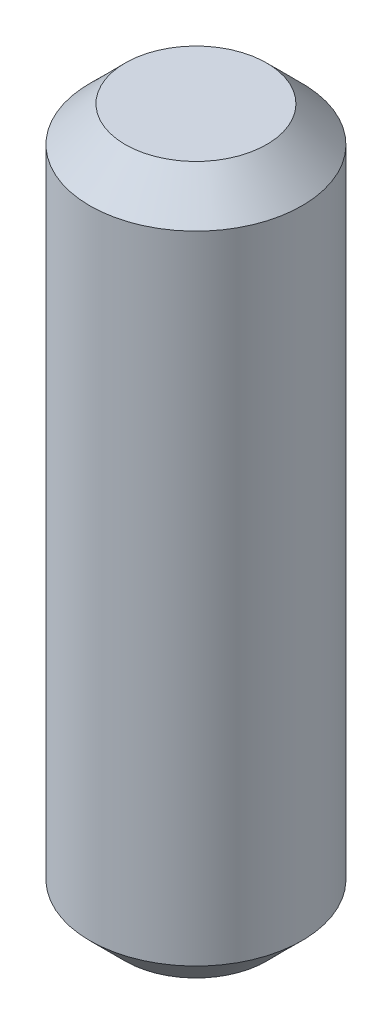
ISO-10303-21;
HEADER;
FILE_DESCRIPTION(('STEP AP214'),'2;1');
FILE_NAME('part.step','',(''),(''),'','','');
FILE_SCHEMA(('AUTOMOTIVE_DESIGN { 1 0 10303 214 1 1 1 1 }'));
ENDSEC;
DATA;
#1=APPLICATION_CONTEXT('core data for automotive mechanical design processes');
#2=APPLICATION_PROTOCOL_DEFINITION('international standard','automotive_design',2000,#1);
#3=PRODUCT_CONTEXT('',#1,'mechanical');
#4=PRODUCT('Part','Part','',(#3));
#5=PRODUCT_RELATED_PRODUCT_CATEGORY('part','',(#4));
#6=PRODUCT_DEFINITION_FORMATION('','',#4);
#7=PRODUCT_DEFINITION_CONTEXT('part definition',#1,'design');
#8=PRODUCT_DEFINITION('design','',#6,#7);
#9=PRODUCT_DEFINITION_SHAPE('','',#8);
#10=(LENGTH_UNIT() NAMED_UNIT(*) SI_UNIT(.MILLI.,.METRE.));
#11=(NAMED_UNIT(*) PLANE_ANGLE_UNIT() SI_UNIT($,.RADIAN.));
#12=(NAMED_UNIT(*) SI_UNIT($,.STERADIAN.) SOLID_ANGLE_UNIT());
#13=UNCERTAINTY_MEASURE_WITH_UNIT(LENGTH_MEASURE(1.E-05),#10,'distance_accuracy_value','');
#14=(GEOMETRIC_REPRESENTATION_CONTEXT(3) GLOBAL_UNCERTAINTY_ASSIGNED_CONTEXT((#13)) GLOBAL_UNIT_ASSIGNED_CONTEXT((#10,
#11,#12)) REPRESENTATION_CONTEXT('',''));
#15=CARTESIAN_POINT('',(0.,0.,0.));
#16=DIRECTION('',(0.,0.,1.));
#17=DIRECTION('',(1.,0.,0.));
#18=AXIS2_PLACEMENT_3D('',#15,#16,#17);
#19=CARTESIAN_POINT('',(0.,5.,0.));
#20=DIRECTION('',(0.,-1.,0.));
#21=DIRECTION('',(0.,0.,-1.));
#22=AXIS2_PLACEMENT_3D('',#19,#20,#21);
#23=CYLINDRICAL_SURFACE('',#22,1.5);
#24=CARTESIAN_POINT('',(0.,-4.5,0.));
#25=DIRECTION('',(0.,1.,0.));
#26=DIRECTION('',(0.,0.,1.));
#27=AXIS2_PLACEMENT_3D('',#24,#25,#26);
#28=CIRCLE('',#27,1.5);
#29=CARTESIAN_POINT('',(0.,-4.5,1.5));
#30=VERTEX_POINT('',#29);
#31=EDGE_CURVE('E51',#30,#30,#28,.T.);
#32=ORIENTED_EDGE('',*,*,#31,.T.);
#33=EDGE_LOOP('',(#32));
#34=FACE_BOUND('',#33,.T.);
#35=CARTESIAN_POINT('',(0.,4.5,0.));
#36=DIRECTION('',(0.,1.,0.));
#37=DIRECTION('',(0.,0.,1.));
#38=AXIS2_PLACEMENT_3D('',#35,#36,#37);
#39=CIRCLE('',#38,1.5);
#40=CARTESIAN_POINT('',(0.,4.5,1.5));
#41=VERTEX_POINT('',#40);
#42=EDGE_CURVE('E55',#41,#41,#39,.F.);
#43=ORIENTED_EDGE('',*,*,#42,.T.);
#44=EDGE_LOOP('',(#43));
#45=FACE_BOUND('',#44,.T.);
#46=ADVANCED_FACE('F39',(#34,#45),#23,.T.);
#47=CARTESIAN_POINT('',(0.,5.,0.));
#48=DIRECTION('',(0.,1.,0.));
#49=DIRECTION('',(0.,0.,1.));
#50=AXIS2_PLACEMENT_3D('',#47,#48,#49);
#51=PLANE('',#50);
#52=CARTESIAN_POINT('',(0.,5.,0.));
#53=DIRECTION('',(0.,1.,0.));
#54=DIRECTION('',(0.,0.,1.));
#55=AXIS2_PLACEMENT_3D('',#52,#53,#54);
#56=CIRCLE('',#55,1.);
#57=CARTESIAN_POINT('',(0.,5.,1.));
#58=VERTEX_POINT('',#57);
#59=EDGE_CURVE('E10',#58,#58,#56,.T.);
#60=ORIENTED_EDGE('',*,*,#59,.T.);
#61=EDGE_LOOP('',(#60));
#62=FACE_BOUND('',#61,.T.);
#63=ADVANCED_FACE('F71',(#62),#51,.T.);
#64=CARTESIAN_POINT('',(0.,-5.,0.));
#65=DIRECTION('',(0.,1.,0.));
#66=DIRECTION('',(0.,0.,1.));
#67=AXIS2_PLACEMENT_3D('',#64,#65,#66);
#68=PLANE('',#67);
#69=CARTESIAN_POINT('',(0.,-5.,0.));
#70=DIRECTION('',(0.,1.,0.));
#71=DIRECTION('',(0.,0.,1.));
#72=AXIS2_PLACEMENT_3D('',#69,#70,#71);
#73=CIRCLE('',#72,0.999999999999999);
#74=CARTESIAN_POINT('',(0.,-5.,0.999999999999999));
#75=VERTEX_POINT('',#74);
#76=EDGE_CURVE('E47',#75,#75,#73,.F.);
#77=ORIENTED_EDGE('',*,*,#76,.T.);
#78=EDGE_LOOP('',(#77));
#79=FACE_BOUND('',#78,.T.);
#80=ADVANCED_FACE('F68',(#79),#68,.F.);
#81=CARTESIAN_POINT('',(0.,-4.5,0.));
#82=DIRECTION('',(0.,1.,0.));
#83=DIRECTION('',(0.,0.,1.));
#84=AXIS2_PLACEMENT_3D('',#81,#82,#83);
#85=CONICAL_SURFACE('',#84,1.5,0.78539816339745);
#86=ORIENTED_EDGE('',*,*,#76,.F.);
#87=EDGE_LOOP('',(#86));
#88=FACE_BOUND('',#87,.T.);
#89=ORIENTED_EDGE('',*,*,#31,.F.);
#90=EDGE_LOOP('',(#89));
#91=FACE_BOUND('',#90,.T.);
#92=ADVANCED_FACE('F64',(#88,#91),#85,.T.);
#93=CARTESIAN_POINT('',(0.,5.,0.));
#94=DIRECTION('',(0.,-1.,0.));
#95=DIRECTION('',(0.,0.,-1.));
#96=AXIS2_PLACEMENT_3D('',#93,#94,#95);
#97=CONICAL_SURFACE('',#96,1.,0.785398163397446);
#98=ORIENTED_EDGE('',*,*,#42,.F.);
#99=EDGE_LOOP('',(#98));
#100=FACE_BOUND('',#99,.T.);
#101=ORIENTED_EDGE('',*,*,#59,.F.);
#102=EDGE_LOOP('',(#101));
#103=FACE_BOUND('',#102,.T.);
#104=ADVANCED_FACE('F42',(#100,#103),#97,.T.);
#105=CLOSED_SHELL('',(#46,#63,#80,#92,#104));
#106=MANIFOLD_SOLID_BREP('B2',#105);
#107=ADVANCED_BREP_SHAPE_REPRESENTATION('',(#18,#106),#14);
#108=SHAPE_DEFINITION_REPRESENTATION(#9,#107);
ENDSEC;
END-ISO-10303-21;
